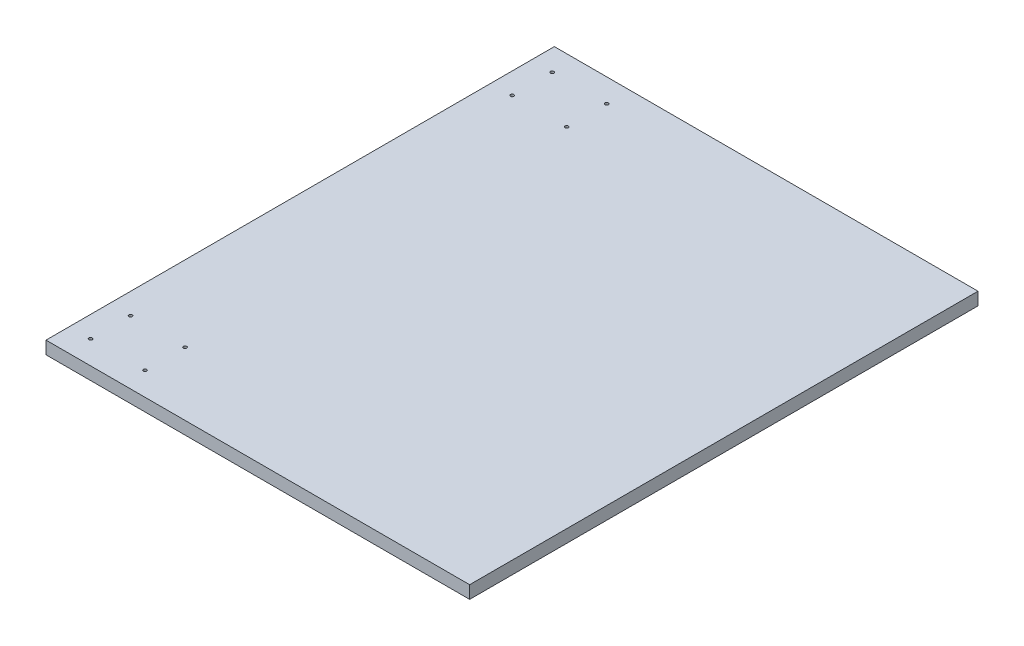
ISO-10303-21;
HEADER;
FILE_DESCRIPTION(('STEP AP214'),'2;1');
FILE_NAME('part.step','',(''),(''),'','','');
FILE_SCHEMA(('AUTOMOTIVE_DESIGN { 1 0 10303 214 1 1 1 1 }'));
ENDSEC;
DATA;
#1=APPLICATION_CONTEXT('core data for automotive mechanical design processes');
#2=APPLICATION_PROTOCOL_DEFINITION('international standard','automotive_design',2000,#1);
#3=PRODUCT_CONTEXT('',#1,'mechanical');
#4=PRODUCT('Part','Part','',(#3));
#5=PRODUCT_RELATED_PRODUCT_CATEGORY('part','',(#4));
#6=PRODUCT_DEFINITION_FORMATION('','',#4);
#7=PRODUCT_DEFINITION_CONTEXT('part definition',#1,'design');
#8=PRODUCT_DEFINITION('design','',#6,#7);
#9=PRODUCT_DEFINITION_SHAPE('','',#8);
#10=(LENGTH_UNIT() NAMED_UNIT(*) SI_UNIT(.MILLI.,.METRE.));
#11=(NAMED_UNIT(*) PLANE_ANGLE_UNIT() SI_UNIT($,.RADIAN.));
#12=(NAMED_UNIT(*) SI_UNIT($,.STERADIAN.) SOLID_ANGLE_UNIT());
#13=UNCERTAINTY_MEASURE_WITH_UNIT(LENGTH_MEASURE(1.E-05),#10,'distance_accuracy_value','');
#14=(GEOMETRIC_REPRESENTATION_CONTEXT(3) GLOBAL_UNCERTAINTY_ASSIGNED_CONTEXT((#13)) GLOBAL_UNIT_ASSIGNED_CONTEXT((#10,
#11,#12)) REPRESENTATION_CONTEXT('',''));
#15=CARTESIAN_POINT('',(0.,0.,0.));
#16=DIRECTION('',(0.,0.,1.));
#17=DIRECTION('',(1.,0.,0.));
#18=AXIS2_PLACEMENT_3D('',#15,#16,#17);
#19=CARTESIAN_POINT('',(-190.5,11.4554,228.6));
#20=DIRECTION('',(-1.,0.,0.));
#21=DIRECTION('',(0.,0.,1.));
#22=AXIS2_PLACEMENT_3D('',#19,#20,#21);
#23=PLANE('',#22);
#24=DIRECTION('',(0.,0.,-1.));
#25=VECTOR('',#24,1.);
#26=CARTESIAN_POINT('',(-190.5,0.,228.6));
#27=LINE('',#26,#25);
#28=CARTESIAN_POINT('',(-190.5,0.,228.6));
#29=VERTEX_POINT('',#28);
#30=CARTESIAN_POINT('',(-190.5,0.,-228.6));
#31=VERTEX_POINT('',#30);
#32=EDGE_CURVE('E99',#29,#31,#27,.T.);
#33=ORIENTED_EDGE('',*,*,#32,.F.);
#34=DIRECTION('',(0.,-1.,0.));
#35=VECTOR('',#34,1.);
#36=CARTESIAN_POINT('',(-190.5,11.4554,228.6));
#37=LINE('',#36,#35);
#38=CARTESIAN_POINT('',(-190.5,11.4554,228.6));
#39=VERTEX_POINT('',#38);
#40=EDGE_CURVE('E11',#39,#29,#37,.T.);
#41=ORIENTED_EDGE('',*,*,#40,.F.);
#42=DIRECTION('',(0.,0.,-1.));
#43=VECTOR('',#42,1.);
#44=CARTESIAN_POINT('',(-190.5,11.4554,228.6));
#45=LINE('',#44,#43);
#46=CARTESIAN_POINT('',(-190.5,11.4554,-228.6));
#47=VERTEX_POINT('',#46);
#48=EDGE_CURVE('E93',#39,#47,#45,.T.);
#49=ORIENTED_EDGE('',*,*,#48,.T.);
#50=DIRECTION('',(0.,-1.,0.));
#51=VECTOR('',#50,1.);
#52=CARTESIAN_POINT('',(-190.5,11.4554,-228.6));
#53=LINE('',#52,#51);
#54=EDGE_CURVE('E36',#47,#31,#53,.T.);
#55=ORIENTED_EDGE('',*,*,#54,.T.);
#56=EDGE_LOOP('',(#33,#41,#49,#55));
#57=FACE_BOUND('',#56,.T.);
#58=ADVANCED_FACE('F33',(#57),#23,.T.);
#59=CARTESIAN_POINT('',(-190.5,11.4554,228.6));
#60=DIRECTION('',(0.,0.,-1.));
#61=DIRECTION('',(-1.,0.,0.));
#62=AXIS2_PLACEMENT_3D('',#59,#60,#61);
#63=PLANE('',#62);
#64=DIRECTION('',(1.,0.,0.));
#65=VECTOR('',#64,1.);
#66=CARTESIAN_POINT('',(-190.5,0.,228.6));
#67=LINE('',#66,#65);
#68=CARTESIAN_POINT('',(190.5,0.,228.6));
#69=VERTEX_POINT('',#68);
#70=EDGE_CURVE('E66',#29,#69,#67,.T.);
#71=ORIENTED_EDGE('',*,*,#70,.T.);
#72=DIRECTION('',(0.,-1.,0.));
#73=VECTOR('',#72,1.);
#74=CARTESIAN_POINT('',(190.5,11.4554,228.6));
#75=LINE('',#74,#73);
#76=CARTESIAN_POINT('',(190.5,11.4554,228.6));
#77=VERTEX_POINT('',#76);
#78=EDGE_CURVE('E42',#77,#69,#75,.T.);
#79=ORIENTED_EDGE('',*,*,#78,.F.);
#80=DIRECTION('',(1.,0.,0.));
#81=VECTOR('',#80,1.);
#82=CARTESIAN_POINT('',(-190.5,11.4554,228.6));
#83=LINE('',#82,#81);
#84=EDGE_CURVE('E83',#39,#77,#83,.T.);
#85=ORIENTED_EDGE('',*,*,#84,.F.);
#86=ORIENTED_EDGE('',*,*,#40,.T.);
#87=EDGE_LOOP('',(#71,#79,#85,#86));
#88=FACE_BOUND('',#87,.T.);
#89=ADVANCED_FACE('F110',(#88),#63,.F.);
#90=CARTESIAN_POINT('',(190.5,11.4554,228.6));
#91=DIRECTION('',(-1.,0.,0.));
#92=DIRECTION('',(0.,0.,1.));
#93=AXIS2_PLACEMENT_3D('',#90,#91,#92);
#94=PLANE('',#93);
#95=DIRECTION('',(0.,0.,-1.));
#96=VECTOR('',#95,1.);
#97=CARTESIAN_POINT('',(190.5,0.,228.6));
#98=LINE('',#97,#96);
#99=CARTESIAN_POINT('',(190.5,0.,-228.6));
#100=VERTEX_POINT('',#99);
#101=EDGE_CURVE('E90',#69,#100,#98,.T.);
#102=ORIENTED_EDGE('',*,*,#101,.T.);
#103=DIRECTION('',(0.,-1.,0.));
#104=VECTOR('',#103,1.);
#105=CARTESIAN_POINT('',(190.5,11.4554,-228.6));
#106=LINE('',#105,#104);
#107=CARTESIAN_POINT('',(190.5,11.4554,-228.6));
#108=VERTEX_POINT('',#107);
#109=EDGE_CURVE('E87',#108,#100,#106,.T.);
#110=ORIENTED_EDGE('',*,*,#109,.F.);
#111=DIRECTION('',(0.,0.,-1.));
#112=VECTOR('',#111,1.);
#113=CARTESIAN_POINT('',(190.5,11.4554,228.6));
#114=LINE('',#113,#112);
#115=EDGE_CURVE('E78',#77,#108,#114,.T.);
#116=ORIENTED_EDGE('',*,*,#115,.F.);
#117=ORIENTED_EDGE('',*,*,#78,.T.);
#118=EDGE_LOOP('',(#102,#110,#116,#117));
#119=FACE_BOUND('',#118,.T.);
#120=ADVANCED_FACE('F88',(#119),#94,.F.);
#121=CARTESIAN_POINT('',(-190.5,11.4554,-228.6));
#122=DIRECTION('',(0.,0.,-1.));
#123=DIRECTION('',(-1.,0.,0.));
#124=AXIS2_PLACEMENT_3D('',#121,#122,#123);
#125=PLANE('',#124);
#126=DIRECTION('',(1.,0.,0.));
#127=VECTOR('',#126,1.);
#128=CARTESIAN_POINT('',(-190.5,0.,-228.6));
#129=LINE('',#128,#127);
#130=EDGE_CURVE('E102',#31,#100,#129,.T.);
#131=ORIENTED_EDGE('',*,*,#130,.F.);
#132=ORIENTED_EDGE('',*,*,#54,.F.);
#133=DIRECTION('',(1.,0.,0.));
#134=VECTOR('',#133,1.);
#135=CARTESIAN_POINT('',(-190.5,11.4554,-228.6));
#136=LINE('',#135,#134);
#137=EDGE_CURVE('E82',#47,#108,#136,.T.);
#138=ORIENTED_EDGE('',*,*,#137,.T.);
#139=ORIENTED_EDGE('',*,*,#109,.T.);
#140=EDGE_LOOP('',(#131,#132,#138,#139));
#141=FACE_BOUND('',#140,.T.);
#142=ADVANCED_FACE('F92',(#141),#125,.T.);
#143=CARTESIAN_POINT('',(0.,11.4554,0.));
#144=DIRECTION('',(0.,-1.,0.));
#145=DIRECTION('',(0.,0.,-1.));
#146=AXIS2_PLACEMENT_3D('',#143,#144,#145);
#147=PLANE('',#146);
#148=CARTESIAN_POINT('',(-171.45,11.4554,-207.6));
#149=DIRECTION('',(0.,1.,0.));
#150=DIRECTION('',(0.,0.,1.));
#151=AXIS2_PLACEMENT_3D('',#148,#149,#150);
#152=CIRCLE('',#151,1.5);
#153=CARTESIAN_POINT('',(-171.45,11.4554,-206.1));
#154=VERTEX_POINT('',#153);
#155=EDGE_CURVE('E194',#154,#154,#152,.T.);
#156=ORIENTED_EDGE('',*,*,#155,.F.);
#157=EDGE_LOOP('',(#156));
#158=FACE_BOUND('',#157,.T.);
#159=CARTESIAN_POINT('',(-171.45,11.4554,-171.6));
#160=DIRECTION('',(0.,1.,0.));
#161=DIRECTION('',(0.,0.,1.));
#162=AXIS2_PLACEMENT_3D('',#159,#160,#161);
#163=CIRCLE('',#162,1.5);
#164=CARTESIAN_POINT('',(-171.45,11.4554,-170.1));
#165=VERTEX_POINT('',#164);
#166=EDGE_CURVE('E200',#165,#165,#163,.T.);
#167=ORIENTED_EDGE('',*,*,#166,.F.);
#168=EDGE_LOOP('',(#167));
#169=FACE_BOUND('',#168,.T.);
#170=CARTESIAN_POINT('',(-122.45,11.4554,-171.6));
#171=DIRECTION('',(0.,1.,0.));
#172=DIRECTION('',(0.,0.,1.));
#173=AXIS2_PLACEMENT_3D('',#170,#171,#172);
#174=CIRCLE('',#173,1.5);
#175=CARTESIAN_POINT('',(-122.45,11.4554,-170.1));
#176=VERTEX_POINT('',#175);
#177=EDGE_CURVE('E206',#176,#176,#174,.T.);
#178=ORIENTED_EDGE('',*,*,#177,.F.);
#179=EDGE_LOOP('',(#178));
#180=FACE_BOUND('',#179,.T.);
#181=CARTESIAN_POINT('',(-122.45,11.4554,171.6));
#182=DIRECTION('',(0.,1.,0.));
#183=DIRECTION('',(0.,0.,-1.));
#184=AXIS2_PLACEMENT_3D('',#181,#182,#183);
#185=CIRCLE('',#184,1.5);
#186=CARTESIAN_POINT('',(-122.45,11.4554,170.1));
#187=VERTEX_POINT('',#186);
#188=EDGE_CURVE('E176',#187,#187,#185,.T.);
#189=ORIENTED_EDGE('',*,*,#188,.F.);
#190=EDGE_LOOP('',(#189));
#191=FACE_BOUND('',#190,.T.);
#192=CARTESIAN_POINT('',(-171.45,11.4554,171.6));
#193=DIRECTION('',(0.,1.,0.));
#194=DIRECTION('',(0.,0.,-1.));
#195=AXIS2_PLACEMENT_3D('',#192,#193,#194);
#196=CIRCLE('',#195,1.5);
#197=CARTESIAN_POINT('',(-171.45,11.4554,170.1));
#198=VERTEX_POINT('',#197);
#199=EDGE_CURVE('E172',#198,#198,#196,.T.);
#200=ORIENTED_EDGE('',*,*,#199,.F.);
#201=EDGE_LOOP('',(#200));
#202=FACE_BOUND('',#201,.T.);
#203=CARTESIAN_POINT('',(-171.45,11.4554,207.6));
#204=DIRECTION('',(0.,1.,0.));
#205=DIRECTION('',(0.,0.,-1.));
#206=AXIS2_PLACEMENT_3D('',#203,#204,#205);
#207=CIRCLE('',#206,1.5);
#208=CARTESIAN_POINT('',(-171.45,11.4554,206.1));
#209=VERTEX_POINT('',#208);
#210=EDGE_CURVE('E179',#209,#209,#207,.T.);
#211=ORIENTED_EDGE('',*,*,#210,.F.);
#212=EDGE_LOOP('',(#211));
#213=FACE_BOUND('',#212,.T.);
#214=CARTESIAN_POINT('',(-122.45,11.4554,207.6));
#215=DIRECTION('',(0.,1.,0.));
#216=DIRECTION('',(0.,0.,-1.));
#217=AXIS2_PLACEMENT_3D('',#214,#215,#216);
#218=CIRCLE('',#217,1.5);
#219=CARTESIAN_POINT('',(-122.45,11.4554,206.1));
#220=VERTEX_POINT('',#219);
#221=EDGE_CURVE('E187',#220,#220,#218,.T.);
#222=ORIENTED_EDGE('',*,*,#221,.F.);
#223=EDGE_LOOP('',(#222));
#224=FACE_BOUND('',#223,.T.);
#225=CARTESIAN_POINT('',(-122.45,11.4554,-207.6));
#226=DIRECTION('',(0.,1.,0.));
#227=DIRECTION('',(0.,0.,1.));
#228=AXIS2_PLACEMENT_3D('',#225,#226,#227);
#229=CIRCLE('',#228,1.5);
#230=CARTESIAN_POINT('',(-122.45,11.4554,-206.1));
#231=VERTEX_POINT('',#230);
#232=EDGE_CURVE('E193',#231,#231,#229,.T.);
#233=ORIENTED_EDGE('',*,*,#232,.F.);
#234=EDGE_LOOP('',(#233));
#235=FACE_BOUND('',#234,.T.);
#236=ORIENTED_EDGE('',*,*,#48,.F.);
#237=ORIENTED_EDGE('',*,*,#84,.T.);
#238=ORIENTED_EDGE('',*,*,#115,.T.);
#239=ORIENTED_EDGE('',*,*,#137,.F.);
#240=EDGE_LOOP('',(#236,#237,#238,#239));
#241=FACE_BOUND('',#240,.T.);
#242=ADVANCED_FACE('F81',(#158,#169,#180,#191,#202,#213,#224,#235,#241),#147,.F.);
#243=CARTESIAN_POINT('',(0.,0.,0.));
#244=DIRECTION('',(0.,-1.,0.));
#245=DIRECTION('',(0.,0.,-1.));
#246=AXIS2_PLACEMENT_3D('',#243,#244,#245);
#247=PLANE('',#246);
#248=CARTESIAN_POINT('',(-171.45,0.,-207.6));
#249=DIRECTION('',(0.,1.,0.));
#250=DIRECTION('',(0.,0.,1.));
#251=AXIS2_PLACEMENT_3D('',#248,#249,#250);
#252=CIRCLE('',#251,1.5);
#253=CARTESIAN_POINT('',(-171.45,0.,-206.1));
#254=VERTEX_POINT('',#253);
#255=EDGE_CURVE('E190',#254,#254,#252,.T.);
#256=ORIENTED_EDGE('',*,*,#255,.T.);
#257=EDGE_LOOP('',(#256));
#258=FACE_BOUND('',#257,.T.);
#259=CARTESIAN_POINT('',(-171.45,0.,-171.6));
#260=DIRECTION('',(0.,1.,0.));
#261=DIRECTION('',(0.,0.,1.));
#262=AXIS2_PLACEMENT_3D('',#259,#260,#261);
#263=CIRCLE('',#262,1.5);
#264=CARTESIAN_POINT('',(-171.45,0.,-170.1));
#265=VERTEX_POINT('',#264);
#266=EDGE_CURVE('E197',#265,#265,#263,.T.);
#267=ORIENTED_EDGE('',*,*,#266,.T.);
#268=EDGE_LOOP('',(#267));
#269=FACE_BOUND('',#268,.T.);
#270=CARTESIAN_POINT('',(-122.45,0.,-171.6));
#271=DIRECTION('',(0.,1.,0.));
#272=DIRECTION('',(0.,0.,1.));
#273=AXIS2_PLACEMENT_3D('',#270,#271,#272);
#274=CIRCLE('',#273,1.5);
#275=CARTESIAN_POINT('',(-122.45,0.,-170.1));
#276=VERTEX_POINT('',#275);
#277=EDGE_CURVE('E203',#276,#276,#274,.T.);
#278=ORIENTED_EDGE('',*,*,#277,.T.);
#279=EDGE_LOOP('',(#278));
#280=FACE_BOUND('',#279,.T.);
#281=CARTESIAN_POINT('',(-122.45,0.,171.6));
#282=DIRECTION('',(0.,1.,0.));
#283=DIRECTION('',(0.,0.,-1.));
#284=AXIS2_PLACEMENT_3D('',#281,#282,#283);
#285=CIRCLE('',#284,1.5);
#286=CARTESIAN_POINT('',(-122.45,0.,170.1));
#287=VERTEX_POINT('',#286);
#288=EDGE_CURVE('E209',#287,#287,#285,.T.);
#289=ORIENTED_EDGE('',*,*,#288,.T.);
#290=EDGE_LOOP('',(#289));
#291=FACE_BOUND('',#290,.T.);
#292=CARTESIAN_POINT('',(-171.45,0.,171.6));
#293=DIRECTION('',(0.,1.,0.));
#294=DIRECTION('',(0.,0.,-1.));
#295=AXIS2_PLACEMENT_3D('',#292,#293,#294);
#296=CIRCLE('',#295,1.5);
#297=CARTESIAN_POINT('',(-171.45,0.,170.1));
#298=VERTEX_POINT('',#297);
#299=EDGE_CURVE('E169',#298,#298,#296,.T.);
#300=ORIENTED_EDGE('',*,*,#299,.T.);
#301=EDGE_LOOP('',(#300));
#302=FACE_BOUND('',#301,.T.);
#303=CARTESIAN_POINT('',(-171.45,0.,207.6));
#304=DIRECTION('',(0.,1.,0.));
#305=DIRECTION('',(0.,0.,-1.));
#306=AXIS2_PLACEMENT_3D('',#303,#304,#305);
#307=CIRCLE('',#306,1.5);
#308=CARTESIAN_POINT('',(-171.45,0.,206.1));
#309=VERTEX_POINT('',#308);
#310=EDGE_CURVE('E174',#309,#309,#307,.T.);
#311=ORIENTED_EDGE('',*,*,#310,.T.);
#312=EDGE_LOOP('',(#311));
#313=FACE_BOUND('',#312,.T.);
#314=CARTESIAN_POINT('',(-122.45,0.,207.6));
#315=DIRECTION('',(0.,1.,0.));
#316=DIRECTION('',(0.,0.,-1.));
#317=AXIS2_PLACEMENT_3D('',#314,#315,#316);
#318=CIRCLE('',#317,1.5);
#319=CARTESIAN_POINT('',(-122.45,0.,206.1));
#320=VERTEX_POINT('',#319);
#321=EDGE_CURVE('E184',#320,#320,#318,.T.);
#322=ORIENTED_EDGE('',*,*,#321,.T.);
#323=EDGE_LOOP('',(#322));
#324=FACE_BOUND('',#323,.T.);
#325=CARTESIAN_POINT('',(-122.45,0.,-207.6));
#326=DIRECTION('',(0.,1.,0.));
#327=DIRECTION('',(0.,0.,1.));
#328=AXIS2_PLACEMENT_3D('',#325,#326,#327);
#329=CIRCLE('',#328,1.5);
#330=CARTESIAN_POINT('',(-122.45,0.,-206.1));
#331=VERTEX_POINT('',#330);
#332=EDGE_CURVE('E103',#331,#331,#329,.T.);
#333=ORIENTED_EDGE('',*,*,#332,.T.);
#334=EDGE_LOOP('',(#333));
#335=FACE_BOUND('',#334,.T.);
#336=ORIENTED_EDGE('',*,*,#32,.T.);
#337=ORIENTED_EDGE('',*,*,#130,.T.);
#338=ORIENTED_EDGE('',*,*,#101,.F.);
#339=ORIENTED_EDGE('',*,*,#70,.F.);
#340=EDGE_LOOP('',(#336,#337,#338,#339));
#341=FACE_BOUND('',#340,.T.);
#342=ADVANCED_FACE('F108',(#258,#269,#280,#291,#302,#313,#324,#335,#341),#247,.T.);
#343=CARTESIAN_POINT('',(-122.45,0.,-207.6));
#344=DIRECTION('',(0.,1.,0.));
#345=DIRECTION('',(0.,0.,1.));
#346=AXIS2_PLACEMENT_3D('',#343,#344,#345);
#347=CYLINDRICAL_SURFACE('',#346,1.5);
#348=ORIENTED_EDGE('',*,*,#332,.F.);
#349=EDGE_LOOP('',(#348));
#350=FACE_BOUND('',#349,.T.);
#351=ORIENTED_EDGE('',*,*,#232,.T.);
#352=EDGE_LOOP('',(#351));
#353=FACE_BOUND('',#352,.T.);
#354=ADVANCED_FACE('F129',(#350,#353),#347,.F.);
#355=CARTESIAN_POINT('',(-122.45,0.,207.6));
#356=DIRECTION('',(0.,1.,0.));
#357=DIRECTION('',(0.,0.,1.));
#358=AXIS2_PLACEMENT_3D('',#355,#356,#357);
#359=CYLINDRICAL_SURFACE('',#358,1.5);
#360=ORIENTED_EDGE('',*,*,#321,.F.);
#361=EDGE_LOOP('',(#360));
#362=FACE_BOUND('',#361,.T.);
#363=ORIENTED_EDGE('',*,*,#221,.T.);
#364=EDGE_LOOP('',(#363));
#365=FACE_BOUND('',#364,.T.);
#366=ADVANCED_FACE('F136',(#362,#365),#359,.F.);
#367=CARTESIAN_POINT('',(-171.45,0.,207.6));
#368=DIRECTION('',(0.,1.,0.));
#369=DIRECTION('',(0.,0.,1.));
#370=AXIS2_PLACEMENT_3D('',#367,#368,#369);
#371=CYLINDRICAL_SURFACE('',#370,1.5);
#372=ORIENTED_EDGE('',*,*,#310,.F.);
#373=EDGE_LOOP('',(#372));
#374=FACE_BOUND('',#373,.T.);
#375=ORIENTED_EDGE('',*,*,#210,.T.);
#376=EDGE_LOOP('',(#375));
#377=FACE_BOUND('',#376,.T.);
#378=ADVANCED_FACE('F157',(#374,#377),#371,.F.);
#379=CARTESIAN_POINT('',(-171.45,0.,171.6));
#380=DIRECTION('',(0.,1.,0.));
#381=DIRECTION('',(0.,0.,1.));
#382=AXIS2_PLACEMENT_3D('',#379,#380,#381);
#383=CYLINDRICAL_SURFACE('',#382,1.5);
#384=ORIENTED_EDGE('',*,*,#299,.F.);
#385=EDGE_LOOP('',(#384));
#386=FACE_BOUND('',#385,.T.);
#387=ORIENTED_EDGE('',*,*,#199,.T.);
#388=EDGE_LOOP('',(#387));
#389=FACE_BOUND('',#388,.T.);
#390=ADVANCED_FACE('F142',(#386,#389),#383,.F.);
#391=CARTESIAN_POINT('',(-122.45,0.,171.6));
#392=DIRECTION('',(0.,1.,0.));
#393=DIRECTION('',(0.,0.,1.));
#394=AXIS2_PLACEMENT_3D('',#391,#392,#393);
#395=CYLINDRICAL_SURFACE('',#394,1.5);
#396=ORIENTED_EDGE('',*,*,#288,.F.);
#397=EDGE_LOOP('',(#396));
#398=FACE_BOUND('',#397,.T.);
#399=ORIENTED_EDGE('',*,*,#188,.T.);
#400=EDGE_LOOP('',(#399));
#401=FACE_BOUND('',#400,.T.);
#402=ADVANCED_FACE('F138',(#398,#401),#395,.F.);
#403=CARTESIAN_POINT('',(-122.45,0.,-171.6));
#404=DIRECTION('',(0.,1.,0.));
#405=DIRECTION('',(0.,0.,1.));
#406=AXIS2_PLACEMENT_3D('',#403,#404,#405);
#407=CYLINDRICAL_SURFACE('',#406,1.5);
#408=ORIENTED_EDGE('',*,*,#277,.F.);
#409=EDGE_LOOP('',(#408));
#410=FACE_BOUND('',#409,.T.);
#411=ORIENTED_EDGE('',*,*,#177,.T.);
#412=EDGE_LOOP('',(#411));
#413=FACE_BOUND('',#412,.T.);
#414=ADVANCED_FACE('F141',(#410,#413),#407,.F.);
#415=CARTESIAN_POINT('',(-171.45,0.,-171.6));
#416=DIRECTION('',(0.,1.,0.));
#417=DIRECTION('',(0.,0.,1.));
#418=AXIS2_PLACEMENT_3D('',#415,#416,#417);
#419=CYLINDRICAL_SURFACE('',#418,1.5);
#420=ORIENTED_EDGE('',*,*,#266,.F.);
#421=EDGE_LOOP('',(#420));
#422=FACE_BOUND('',#421,.T.);
#423=ORIENTED_EDGE('',*,*,#166,.T.);
#424=EDGE_LOOP('',(#423));
#425=FACE_BOUND('',#424,.T.);
#426=ADVANCED_FACE('F146',(#422,#425),#419,.F.);
#427=CARTESIAN_POINT('',(-171.45,0.,-207.6));
#428=DIRECTION('',(0.,1.,0.));
#429=DIRECTION('',(0.,0.,1.));
#430=AXIS2_PLACEMENT_3D('',#427,#428,#429);
#431=CYLINDRICAL_SURFACE('',#430,1.5);
#432=ORIENTED_EDGE('',*,*,#255,.F.);
#433=EDGE_LOOP('',(#432));
#434=FACE_BOUND('',#433,.T.);
#435=ORIENTED_EDGE('',*,*,#155,.T.);
#436=EDGE_LOOP('',(#435));
#437=FACE_BOUND('',#436,.T.);
#438=ADVANCED_FACE('F150',(#434,#437),#431,.F.);
#439=CLOSED_SHELL('',(#58,#89,#120,#142,#242,#342,#354,#366,#378,#390,#402,#414,#426,#438));
#440=MANIFOLD_SOLID_BREP('B2',#439);
#441=ADVANCED_BREP_SHAPE_REPRESENTATION('',(#18,#440),#14);
#442=SHAPE_DEFINITION_REPRESENTATION(#9,#441);
ENDSEC;
END-ISO-10303-21;
